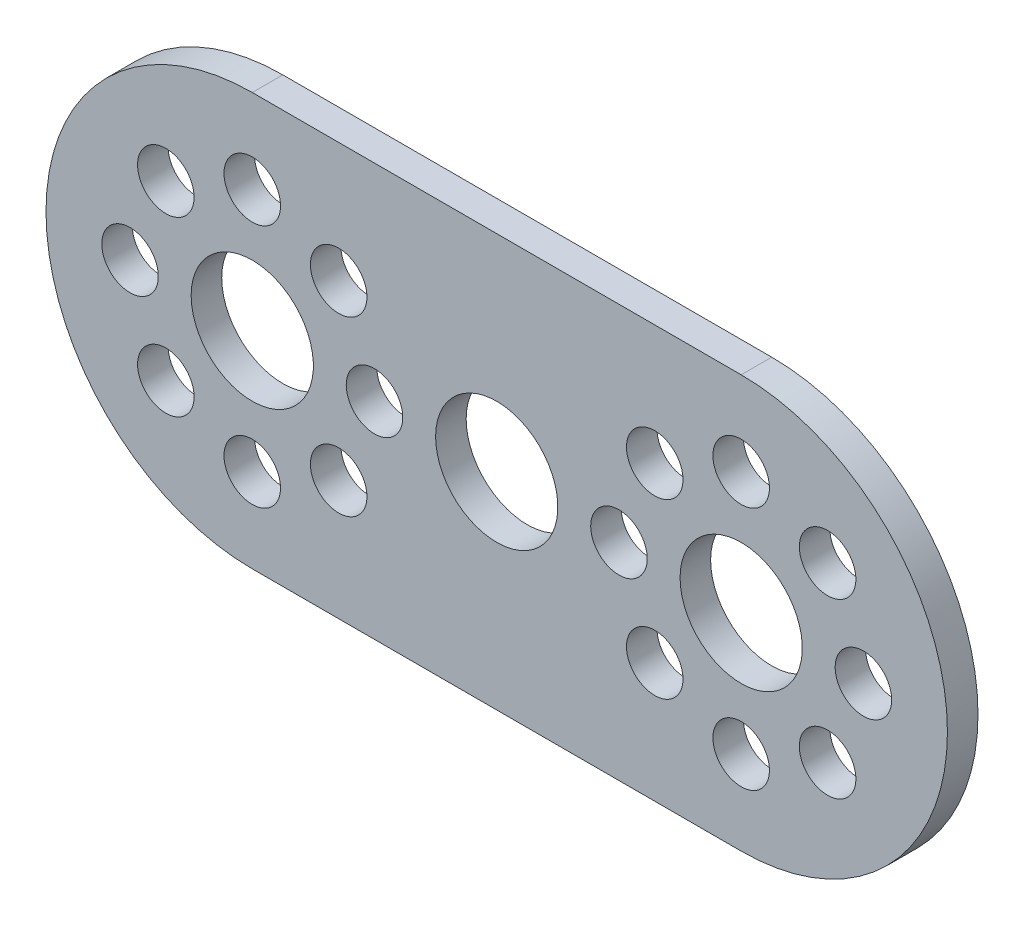
ISO-10303-21;
HEADER;
FILE_DESCRIPTION(('STEP AP214'),'2;1');
FILE_NAME('part.step','',(''),(''),'','','');
FILE_SCHEMA(('AUTOMOTIVE_DESIGN { 1 0 10303 214 1 1 1 1 }'));
ENDSEC;
DATA;
#1=APPLICATION_CONTEXT('core data for automotive mechanical design processes');
#2=APPLICATION_PROTOCOL_DEFINITION('international standard','automotive_design',2000,#1);
#3=PRODUCT_CONTEXT('',#1,'mechanical');
#4=PRODUCT('Part','Part','',(#3));
#5=PRODUCT_RELATED_PRODUCT_CATEGORY('part','',(#4));
#6=PRODUCT_DEFINITION_FORMATION('','',#4);
#7=PRODUCT_DEFINITION_CONTEXT('part definition',#1,'design');
#8=PRODUCT_DEFINITION('design','',#6,#7);
#9=PRODUCT_DEFINITION_SHAPE('','',#8);
#10=(LENGTH_UNIT() NAMED_UNIT(*) SI_UNIT(.MILLI.,.METRE.));
#11=(NAMED_UNIT(*) PLANE_ANGLE_UNIT() SI_UNIT($,.RADIAN.));
#12=(NAMED_UNIT(*) SI_UNIT($,.STERADIAN.) SOLID_ANGLE_UNIT());
#13=UNCERTAINTY_MEASURE_WITH_UNIT(LENGTH_MEASURE(1.E-05),#10,'distance_accuracy_value','');
#14=(GEOMETRIC_REPRESENTATION_CONTEXT(3) GLOBAL_UNCERTAINTY_ASSIGNED_CONTEXT((#13)) GLOBAL_UNIT_ASSIGNED_CONTEXT((#10,
#11,#12)) REPRESENTATION_CONTEXT('',''));
#15=CARTESIAN_POINT('',(0.,0.,0.));
#16=DIRECTION('',(0.,0.,1.));
#17=DIRECTION('',(1.,0.,0.));
#18=AXIS2_PLACEMENT_3D('',#15,#16,#17);
#19=CARTESIAN_POINT('',(-16.,0.,0.));
#20=DIRECTION('',(0.,0.,1.));
#21=DIRECTION('',(1.,0.,0.));
#22=AXIS2_PLACEMENT_3D('',#19,#20,#21);
#23=PLANE('',#22);
#24=CARTESIAN_POINT('',(21.6568542494924,-5.65685424949238,0.));
#25=DIRECTION('',(0.,0.,-1.));
#26=DIRECTION('',(-1.,0.,0.));
#27=AXIS2_PLACEMENT_3D('',#24,#25,#26);
#28=CIRCLE('',#27,1.85);
#29=CARTESIAN_POINT('',(19.8068542494924,-5.65685424949238,0.));
#30=VERTEX_POINT('',#29);
#31=EDGE_CURVE('E141',#30,#30,#28,.F.);
#32=ORIENTED_EDGE('',*,*,#31,.T.);
#33=EDGE_LOOP('',(#32));
#34=FACE_BOUND('',#33,.T.);
#35=CARTESIAN_POINT('',(10.3431457505076,5.65685424949237,0.));
#36=DIRECTION('',(0.,0.,-1.));
#37=DIRECTION('',(-1.,0.,0.));
#38=AXIS2_PLACEMENT_3D('',#35,#36,#37);
#39=CIRCLE('',#38,1.85);
#40=CARTESIAN_POINT('',(8.49314575050761,5.65685424949237,0.));
#41=VERTEX_POINT('',#40);
#42=EDGE_CURVE('E144',#41,#41,#39,.F.);
#43=ORIENTED_EDGE('',*,*,#42,.T.);
#44=EDGE_LOOP('',(#43));
#45=FACE_BOUND('',#44,.T.);
#46=CARTESIAN_POINT('',(-10.3431457505076,5.65685424949239,0.));
#47=DIRECTION('',(0.,0.,-1.));
#48=DIRECTION('',(-1.,0.,0.));
#49=AXIS2_PLACEMENT_3D('',#46,#47,#48);
#50=CIRCLE('',#49,1.85);
#51=CARTESIAN_POINT('',(-12.1931457505076,5.65685424949239,0.));
#52=VERTEX_POINT('',#51);
#53=EDGE_CURVE('E147',#52,#52,#50,.F.);
#54=ORIENTED_EDGE('',*,*,#53,.T.);
#55=EDGE_LOOP('',(#54));
#56=FACE_BOUND('',#55,.T.);
#57=CARTESIAN_POINT('',(10.3431457505076,-5.65685424949239,0.));
#58=DIRECTION('',(0.,0.,-1.));
#59=DIRECTION('',(-1.,0.,0.));
#60=AXIS2_PLACEMENT_3D('',#57,#58,#59);
#61=CIRCLE('',#60,1.85000000000002);
#62=CARTESIAN_POINT('',(8.4931457505076,-5.65685424949239,0.));
#63=VERTEX_POINT('',#62);
#64=EDGE_CURVE('E150',#63,#63,#61,.F.);
#65=ORIENTED_EDGE('',*,*,#64,.T.);
#66=EDGE_LOOP('',(#65));
#67=FACE_BOUND('',#66,.T.);
#68=CARTESIAN_POINT('',(0.,0.,0.));
#69=DIRECTION('',(0.,0.,-1.));
#70=DIRECTION('',(-1.,0.,0.));
#71=AXIS2_PLACEMENT_3D('',#68,#69,#70);
#72=CIRCLE('',#71,4.);
#73=CARTESIAN_POINT('',(-4.,0.,0.));
#74=VERTEX_POINT('',#73);
#75=EDGE_CURVE('E153',#74,#74,#72,.F.);
#76=ORIENTED_EDGE('',*,*,#75,.T.);
#77=EDGE_LOOP('',(#76));
#78=FACE_BOUND('',#77,.T.);
#79=CARTESIAN_POINT('',(-16.,-8.,0.));
#80=DIRECTION('',(0.,0.,-1.));
#81=DIRECTION('',(-1.,0.,0.));
#82=AXIS2_PLACEMENT_3D('',#79,#80,#81);
#83=CIRCLE('',#82,1.85);
#84=CARTESIAN_POINT('',(-17.85,-8.,0.));
#85=VERTEX_POINT('',#84);
#86=EDGE_CURVE('E156',#85,#85,#83,.F.);
#87=ORIENTED_EDGE('',*,*,#86,.T.);
#88=EDGE_LOOP('',(#87));
#89=FACE_BOUND('',#88,.T.);
#90=CARTESIAN_POINT('',(8.,0.,0.));
#91=DIRECTION('',(0.,0.,-1.));
#92=DIRECTION('',(-1.,0.,0.));
#93=AXIS2_PLACEMENT_3D('',#90,#91,#92);
#94=CIRCLE('',#93,1.85);
#95=CARTESIAN_POINT('',(6.15,0.,0.));
#96=VERTEX_POINT('',#95);
#97=EDGE_CURVE('E159',#96,#96,#94,.F.);
#98=ORIENTED_EDGE('',*,*,#97,.T.);
#99=EDGE_LOOP('',(#98));
#100=FACE_BOUND('',#99,.T.);
#101=CARTESIAN_POINT('',(16.,-8.,0.));
#102=DIRECTION('',(0.,0.,-1.));
#103=DIRECTION('',(-1.,0.,0.));
#104=AXIS2_PLACEMENT_3D('',#101,#102,#103);
#105=CIRCLE('',#104,1.85);
#106=CARTESIAN_POINT('',(14.15,-8.,0.));
#107=VERTEX_POINT('',#106);
#108=EDGE_CURVE('E162',#107,#107,#105,.F.);
#109=ORIENTED_EDGE('',*,*,#108,.T.);
#110=EDGE_LOOP('',(#109));
#111=FACE_BOUND('',#110,.T.);
#112=CARTESIAN_POINT('',(-16.,8.,0.));
#113=DIRECTION('',(0.,0.,-1.));
#114=DIRECTION('',(-1.,0.,0.));
#115=AXIS2_PLACEMENT_3D('',#112,#113,#114);
#116=CIRCLE('',#115,1.85);
#117=CARTESIAN_POINT('',(-17.85,8.,0.));
#118=VERTEX_POINT('',#117);
#119=EDGE_CURVE('E165',#118,#118,#116,.F.);
#120=ORIENTED_EDGE('',*,*,#119,.T.);
#121=EDGE_LOOP('',(#120));
#122=FACE_BOUND('',#121,.T.);
#123=CARTESIAN_POINT('',(-16.,0.,0.));
#124=DIRECTION('',(0.,0.,-1.));
#125=DIRECTION('',(-1.,0.,0.));
#126=AXIS2_PLACEMENT_3D('',#123,#124,#125);
#127=CIRCLE('',#126,4.);
#128=CARTESIAN_POINT('',(-20.,0.,0.));
#129=VERTEX_POINT('',#128);
#130=EDGE_CURVE('E168',#129,#129,#127,.F.);
#131=ORIENTED_EDGE('',*,*,#130,.T.);
#132=EDGE_LOOP('',(#131));
#133=FACE_BOUND('',#132,.T.);
#134=CARTESIAN_POINT('',(16.,0.,0.));
#135=DIRECTION('',(0.,0.,-1.));
#136=DIRECTION('',(-1.,0.,0.));
#137=AXIS2_PLACEMENT_3D('',#134,#135,#136);
#138=CIRCLE('',#137,4.);
#139=CARTESIAN_POINT('',(12.,0.,0.));
#140=VERTEX_POINT('',#139);
#141=EDGE_CURVE('E171',#140,#140,#138,.F.);
#142=ORIENTED_EDGE('',*,*,#141,.T.);
#143=EDGE_LOOP('',(#142));
#144=FACE_BOUND('',#143,.T.);
#145=CARTESIAN_POINT('',(16.,8.,0.));
#146=DIRECTION('',(0.,0.,-1.));
#147=DIRECTION('',(-1.,0.,0.));
#148=AXIS2_PLACEMENT_3D('',#145,#146,#147);
#149=CIRCLE('',#148,1.85);
#150=CARTESIAN_POINT('',(14.15,8.,0.));
#151=VERTEX_POINT('',#150);
#152=EDGE_CURVE('E174',#151,#151,#149,.F.);
#153=ORIENTED_EDGE('',*,*,#152,.T.);
#154=EDGE_LOOP('',(#153));
#155=FACE_BOUND('',#154,.T.);
#156=CARTESIAN_POINT('',(24.,0.,0.));
#157=DIRECTION('',(0.,0.,-1.));
#158=DIRECTION('',(-1.,0.,0.));
#159=AXIS2_PLACEMENT_3D('',#156,#157,#158);
#160=CIRCLE('',#159,1.85);
#161=CARTESIAN_POINT('',(22.15,0.,0.));
#162=VERTEX_POINT('',#161);
#163=EDGE_CURVE('E177',#162,#162,#160,.F.);
#164=ORIENTED_EDGE('',*,*,#163,.T.);
#165=EDGE_LOOP('',(#164));
#166=FACE_BOUND('',#165,.T.);
#167=CARTESIAN_POINT('',(-8.,0.,0.));
#168=DIRECTION('',(0.,0.,-1.));
#169=DIRECTION('',(-1.,0.,0.));
#170=AXIS2_PLACEMENT_3D('',#167,#168,#169);
#171=CIRCLE('',#170,1.85);
#172=CARTESIAN_POINT('',(-9.85,0.,0.));
#173=VERTEX_POINT('',#172);
#174=EDGE_CURVE('E180',#173,#173,#171,.F.);
#175=ORIENTED_EDGE('',*,*,#174,.T.);
#176=EDGE_LOOP('',(#175));
#177=FACE_BOUND('',#176,.T.);
#178=CARTESIAN_POINT('',(-24.,0.,0.));
#179=DIRECTION('',(0.,0.,-1.));
#180=DIRECTION('',(-1.,0.,0.));
#181=AXIS2_PLACEMENT_3D('',#178,#179,#180);
#182=CIRCLE('',#181,1.85);
#183=CARTESIAN_POINT('',(-25.85,0.,0.));
#184=VERTEX_POINT('',#183);
#185=EDGE_CURVE('E183',#184,#184,#182,.F.);
#186=ORIENTED_EDGE('',*,*,#185,.T.);
#187=EDGE_LOOP('',(#186));
#188=FACE_BOUND('',#187,.T.);
#189=CARTESIAN_POINT('',(-21.6568542494924,-5.65685424949239,0.));
#190=DIRECTION('',(0.,0.,-1.));
#191=DIRECTION('',(-1.,0.,0.));
#192=AXIS2_PLACEMENT_3D('',#189,#190,#191);
#193=CIRCLE('',#192,1.85);
#194=CARTESIAN_POINT('',(-23.5068542494924,-5.65685424949239,0.));
#195=VERTEX_POINT('',#194);
#196=EDGE_CURVE('E186',#195,#195,#193,.F.);
#197=ORIENTED_EDGE('',*,*,#196,.T.);
#198=EDGE_LOOP('',(#197));
#199=FACE_BOUND('',#198,.T.);
#200=CARTESIAN_POINT('',(-21.6568542494924,5.65685424949237,0.));
#201=DIRECTION('',(0.,0.,-1.));
#202=DIRECTION('',(-1.,0.,0.));
#203=AXIS2_PLACEMENT_3D('',#200,#201,#202);
#204=CIRCLE('',#203,1.85);
#205=CARTESIAN_POINT('',(-23.5068542494924,5.65685424949237,0.));
#206=VERTEX_POINT('',#205);
#207=EDGE_CURVE('E189',#206,#206,#204,.F.);
#208=ORIENTED_EDGE('',*,*,#207,.T.);
#209=EDGE_LOOP('',(#208));
#210=FACE_BOUND('',#209,.T.);
#211=CARTESIAN_POINT('',(-10.3431457505076,-5.65685424949237,0.));
#212=DIRECTION('',(0.,0.,-1.));
#213=DIRECTION('',(-1.,0.,0.));
#214=AXIS2_PLACEMENT_3D('',#211,#212,#213);
#215=CIRCLE('',#214,1.85);
#216=CARTESIAN_POINT('',(-12.1931457505076,-5.65685424949237,0.));
#217=VERTEX_POINT('',#216);
#218=EDGE_CURVE('E192',#217,#217,#215,.F.);
#219=ORIENTED_EDGE('',*,*,#218,.T.);
#220=EDGE_LOOP('',(#219));
#221=FACE_BOUND('',#220,.T.);
#222=CARTESIAN_POINT('',(21.6568542494924,5.65685424949239,0.));
#223=DIRECTION('',(0.,0.,-1.));
#224=DIRECTION('',(-1.,0.,0.));
#225=AXIS2_PLACEMENT_3D('',#222,#223,#224);
#226=CIRCLE('',#225,1.85);
#227=CARTESIAN_POINT('',(19.8068542494924,5.65685424949239,0.));
#228=VERTEX_POINT('',#227);
#229=EDGE_CURVE('E195',#228,#228,#226,.F.);
#230=ORIENTED_EDGE('',*,*,#229,.T.);
#231=EDGE_LOOP('',(#230));
#232=FACE_BOUND('',#231,.T.);
#233=DIRECTION('',(1.,0.,0.));
#234=VECTOR('',#233,1.);
#235=CARTESIAN_POINT('',(-16.,13.5,0.));
#236=LINE('',#235,#234);
#237=CARTESIAN_POINT('',(-16.,13.5,0.));
#238=VERTEX_POINT('',#237);
#239=CARTESIAN_POINT('',(16.,13.5,0.));
#240=VERTEX_POINT('',#239);
#241=EDGE_CURVE('E58',#238,#240,#236,.T.);
#242=ORIENTED_EDGE('',*,*,#241,.T.);
#243=CARTESIAN_POINT('',(16.,0.,0.));
#244=DIRECTION('',(0.,0.,-1.));
#245=DIRECTION('',(-1.,0.,0.));
#246=AXIS2_PLACEMENT_3D('',#243,#244,#245);
#247=CIRCLE('',#246,13.5);
#248=CARTESIAN_POINT('',(16.,-13.5,0.));
#249=VERTEX_POINT('',#248);
#250=EDGE_CURVE('E18',#249,#240,#247,.F.);
#251=ORIENTED_EDGE('',*,*,#250,.F.);
#252=DIRECTION('',(1.,0.,0.));
#253=VECTOR('',#252,1.);
#254=CARTESIAN_POINT('',(-16.,-13.5,0.));
#255=LINE('',#254,#253);
#256=CARTESIAN_POINT('',(-16.,-13.5,0.));
#257=VERTEX_POINT('',#256);
#258=EDGE_CURVE('E53',#249,#257,#255,.F.);
#259=ORIENTED_EDGE('',*,*,#258,.T.);
#260=CARTESIAN_POINT('',(-16.,0.,0.));
#261=DIRECTION('',(0.,0.,-1.));
#262=DIRECTION('',(-1.,0.,0.));
#263=AXIS2_PLACEMENT_3D('',#260,#261,#262);
#264=CIRCLE('',#263,13.5);
#265=EDGE_CURVE('E61',#238,#257,#264,.F.);
#266=ORIENTED_EDGE('',*,*,#265,.F.);
#267=EDGE_LOOP('',(#242,#251,#259,#266));
#268=FACE_BOUND('',#267,.T.);
#269=ADVANCED_FACE('F15',(#34,#45,#56,#67,#78,#89,#100,#111,#122,#133,#144,#155,#166,#177,#188,
#199,#210,#221,#232,#268),#23,.F.);
#270=CARTESIAN_POINT('',(-16.,-13.5,2.));
#271=DIRECTION('',(0.,1.,0.));
#272=DIRECTION('',(0.,0.,1.));
#273=AXIS2_PLACEMENT_3D('',#270,#271,#272);
#274=PLANE('',#273);
#275=DIRECTION('',(1.,0.,0.));
#276=VECTOR('',#275,1.);
#277=CARTESIAN_POINT('',(-16.,-13.5,2.));
#278=LINE('',#277,#276);
#279=CARTESIAN_POINT('',(-16.,-13.5,2.));
#280=VERTEX_POINT('',#279);
#281=CARTESIAN_POINT('',(16.,-13.5,2.));
#282=VERTEX_POINT('',#281);
#283=EDGE_CURVE('E139',#280,#282,#278,.T.);
#284=ORIENTED_EDGE('',*,*,#283,.F.);
#285=DIRECTION('',(0.,0.,-1.));
#286=VECTOR('',#285,1.);
#287=CARTESIAN_POINT('',(-16.,-13.5,2.));
#288=LINE('',#287,#286);
#289=EDGE_CURVE('E75',#257,#280,#288,.F.);
#290=ORIENTED_EDGE('',*,*,#289,.F.);
#291=ORIENTED_EDGE('',*,*,#258,.F.);
#292=DIRECTION('',(0.,0.,-1.));
#293=VECTOR('',#292,1.);
#294=CARTESIAN_POINT('',(16.,-13.5,2.));
#295=LINE('',#294,#293);
#296=EDGE_CURVE('E70',#282,#249,#295,.T.);
#297=ORIENTED_EDGE('',*,*,#296,.F.);
#298=EDGE_LOOP('',(#284,#290,#291,#297));
#299=FACE_BOUND('',#298,.T.);
#300=ADVANCED_FACE('F203',(#299),#274,.F.);
#301=CARTESIAN_POINT('',(16.,0.,2.));
#302=DIRECTION('',(0.,0.,-1.));
#303=DIRECTION('',(-1.,0.,0.));
#304=AXIS2_PLACEMENT_3D('',#301,#302,#303);
#305=CYLINDRICAL_SURFACE('',#304,13.5);
#306=ORIENTED_EDGE('',*,*,#296,.T.);
#307=ORIENTED_EDGE('',*,*,#250,.T.);
#308=DIRECTION('',(0.,0.,-1.));
#309=VECTOR('',#308,1.);
#310=CARTESIAN_POINT('',(16.,13.5,2.));
#311=LINE('',#310,#309);
#312=CARTESIAN_POINT('',(16.,13.5,2.));
#313=VERTEX_POINT('',#312);
#314=EDGE_CURVE('E64',#240,#313,#311,.F.);
#315=ORIENTED_EDGE('',*,*,#314,.T.);
#316=CARTESIAN_POINT('',(16.,0.,2.));
#317=DIRECTION('',(0.,0.,-1.));
#318=DIRECTION('',(-1.,0.,0.));
#319=AXIS2_PLACEMENT_3D('',#316,#317,#318);
#320=CIRCLE('',#319,13.5);
#321=EDGE_CURVE('E137',#282,#313,#320,.F.);
#322=ORIENTED_EDGE('',*,*,#321,.F.);
#323=EDGE_LOOP('',(#306,#307,#315,#322));
#324=FACE_BOUND('',#323,.T.);
#325=ADVANCED_FACE('F67',(#324),#305,.T.);
#326=CARTESIAN_POINT('',(-16.,13.5,2.));
#327=DIRECTION('',(0.,-1.,0.));
#328=DIRECTION('',(0.,0.,-1.));
#329=AXIS2_PLACEMENT_3D('',#326,#327,#328);
#330=PLANE('',#329);
#331=DIRECTION('',(1.,0.,0.));
#332=VECTOR('',#331,1.);
#333=CARTESIAN_POINT('',(-16.,13.5,2.));
#334=LINE('',#333,#332);
#335=CARTESIAN_POINT('',(-16.,13.5,2.));
#336=VERTEX_POINT('',#335);
#337=EDGE_CURVE('E73',#313,#336,#334,.F.);
#338=ORIENTED_EDGE('',*,*,#337,.F.);
#339=ORIENTED_EDGE('',*,*,#314,.F.);
#340=ORIENTED_EDGE('',*,*,#241,.F.);
#341=DIRECTION('',(0.,0.,-1.));
#342=VECTOR('',#341,1.);
#343=CARTESIAN_POINT('',(-16.,13.5,2.));
#344=LINE('',#343,#342);
#345=EDGE_CURVE('E77',#336,#238,#344,.T.);
#346=ORIENTED_EDGE('',*,*,#345,.F.);
#347=EDGE_LOOP('',(#338,#339,#340,#346));
#348=FACE_BOUND('',#347,.T.);
#349=ADVANCED_FACE('F71',(#348),#330,.F.);
#350=CARTESIAN_POINT('',(-16.,0.,2.));
#351=DIRECTION('',(0.,0.,-1.));
#352=DIRECTION('',(-1.,0.,0.));
#353=AXIS2_PLACEMENT_3D('',#350,#351,#352);
#354=CYLINDRICAL_SURFACE('',#353,13.5);
#355=ORIENTED_EDGE('',*,*,#345,.T.);
#356=ORIENTED_EDGE('',*,*,#265,.T.);
#357=ORIENTED_EDGE('',*,*,#289,.T.);
#358=CARTESIAN_POINT('',(-16.,0.,2.));
#359=DIRECTION('',(0.,0.,-1.));
#360=DIRECTION('',(-1.,0.,0.));
#361=AXIS2_PLACEMENT_3D('',#358,#359,#360);
#362=CIRCLE('',#361,13.5);
#363=EDGE_CURVE('E33',#336,#280,#362,.F.);
#364=ORIENTED_EDGE('',*,*,#363,.F.);
#365=EDGE_LOOP('',(#355,#356,#357,#364));
#366=FACE_BOUND('',#365,.T.);
#367=ADVANCED_FACE('F197',(#366),#354,.T.);
#368=CARTESIAN_POINT('',(21.6568542494924,5.65685424949239,2.));
#369=DIRECTION('',(0.,0.,-1.));
#370=DIRECTION('',(-1.,0.,0.));
#371=AXIS2_PLACEMENT_3D('',#368,#369,#370);
#372=CYLINDRICAL_SURFACE('',#371,1.85);
#373=ORIENTED_EDGE('',*,*,#229,.F.);
#374=EDGE_LOOP('',(#373));
#375=FACE_BOUND('',#374,.T.);
#376=CARTESIAN_POINT('',(21.6568542494924,5.65685424949239,2.));
#377=DIRECTION('',(0.,0.,-1.));
#378=DIRECTION('',(-1.,0.,0.));
#379=AXIS2_PLACEMENT_3D('',#376,#377,#378);
#380=CIRCLE('',#379,1.85);
#381=CARTESIAN_POINT('',(19.8068542494924,5.65685424949239,2.));
#382=VERTEX_POINT('',#381);
#383=EDGE_CURVE('E134',#382,#382,#380,.T.);
#384=ORIENTED_EDGE('',*,*,#383,.F.);
#385=EDGE_LOOP('',(#384));
#386=FACE_BOUND('',#385,.T.);
#387=ADVANCED_FACE('F290',(#375,#386),#372,.F.);
#388=CARTESIAN_POINT('',(-10.3431457505076,-5.65685424949237,2.));
#389=DIRECTION('',(0.,0.,-1.));
#390=DIRECTION('',(-1.,0.,0.));
#391=AXIS2_PLACEMENT_3D('',#388,#389,#390);
#392=CYLINDRICAL_SURFACE('',#391,1.85);
#393=ORIENTED_EDGE('',*,*,#218,.F.);
#394=EDGE_LOOP('',(#393));
#395=FACE_BOUND('',#394,.T.);
#396=CARTESIAN_POINT('',(-10.3431457505076,-5.65685424949237,2.));
#397=DIRECTION('',(0.,0.,-1.));
#398=DIRECTION('',(-1.,0.,0.));
#399=AXIS2_PLACEMENT_3D('',#396,#397,#398);
#400=CIRCLE('',#399,1.85);
#401=CARTESIAN_POINT('',(-12.1931457505076,-5.65685424949237,2.));
#402=VERTEX_POINT('',#401);
#403=EDGE_CURVE('E131',#402,#402,#400,.T.);
#404=ORIENTED_EDGE('',*,*,#403,.F.);
#405=EDGE_LOOP('',(#404));
#406=FACE_BOUND('',#405,.T.);
#407=ADVANCED_FACE('F286',(#395,#406),#392,.F.);
#408=CARTESIAN_POINT('',(-21.6568542494924,5.65685424949237,2.));
#409=DIRECTION('',(0.,0.,-1.));
#410=DIRECTION('',(-1.,0.,0.));
#411=AXIS2_PLACEMENT_3D('',#408,#409,#410);
#412=CYLINDRICAL_SURFACE('',#411,1.85);
#413=ORIENTED_EDGE('',*,*,#207,.F.);
#414=EDGE_LOOP('',(#413));
#415=FACE_BOUND('',#414,.T.);
#416=CARTESIAN_POINT('',(-21.6568542494924,5.65685424949237,2.));
#417=DIRECTION('',(0.,0.,-1.));
#418=DIRECTION('',(-1.,0.,0.));
#419=AXIS2_PLACEMENT_3D('',#416,#417,#418);
#420=CIRCLE('',#419,1.85);
#421=CARTESIAN_POINT('',(-23.5068542494924,5.65685424949237,2.));
#422=VERTEX_POINT('',#421);
#423=EDGE_CURVE('E128',#422,#422,#420,.T.);
#424=ORIENTED_EDGE('',*,*,#423,.F.);
#425=EDGE_LOOP('',(#424));
#426=FACE_BOUND('',#425,.T.);
#427=ADVANCED_FACE('F282',(#415,#426),#412,.F.);
#428=CARTESIAN_POINT('',(-21.6568542494924,-5.65685424949239,2.));
#429=DIRECTION('',(0.,0.,-1.));
#430=DIRECTION('',(-1.,0.,0.));
#431=AXIS2_PLACEMENT_3D('',#428,#429,#430);
#432=CYLINDRICAL_SURFACE('',#431,1.85);
#433=ORIENTED_EDGE('',*,*,#196,.F.);
#434=EDGE_LOOP('',(#433));
#435=FACE_BOUND('',#434,.T.);
#436=CARTESIAN_POINT('',(-21.6568542494924,-5.65685424949239,2.));
#437=DIRECTION('',(0.,0.,-1.));
#438=DIRECTION('',(-1.,0.,0.));
#439=AXIS2_PLACEMENT_3D('',#436,#437,#438);
#440=CIRCLE('',#439,1.85);
#441=CARTESIAN_POINT('',(-23.5068542494924,-5.65685424949239,2.));
#442=VERTEX_POINT('',#441);
#443=EDGE_CURVE('E125',#442,#442,#440,.T.);
#444=ORIENTED_EDGE('',*,*,#443,.F.);
#445=EDGE_LOOP('',(#444));
#446=FACE_BOUND('',#445,.T.);
#447=ADVANCED_FACE('F278',(#435,#446),#432,.F.);
#448=CARTESIAN_POINT('',(-24.,0.,2.));
#449=DIRECTION('',(0.,0.,-1.));
#450=DIRECTION('',(-1.,0.,0.));
#451=AXIS2_PLACEMENT_3D('',#448,#449,#450);
#452=CYLINDRICAL_SURFACE('',#451,1.85);
#453=ORIENTED_EDGE('',*,*,#185,.F.);
#454=EDGE_LOOP('',(#453));
#455=FACE_BOUND('',#454,.T.);
#456=CARTESIAN_POINT('',(-24.,0.,2.));
#457=DIRECTION('',(0.,0.,-1.));
#458=DIRECTION('',(-1.,0.,0.));
#459=AXIS2_PLACEMENT_3D('',#456,#457,#458);
#460=CIRCLE('',#459,1.85);
#461=CARTESIAN_POINT('',(-25.85,0.,2.));
#462=VERTEX_POINT('',#461);
#463=EDGE_CURVE('E122',#462,#462,#460,.T.);
#464=ORIENTED_EDGE('',*,*,#463,.F.);
#465=EDGE_LOOP('',(#464));
#466=FACE_BOUND('',#465,.T.);
#467=ADVANCED_FACE('F274',(#455,#466),#452,.F.);
#468=CARTESIAN_POINT('',(-8.,0.,2.));
#469=DIRECTION('',(0.,0.,-1.));
#470=DIRECTION('',(-1.,0.,0.));
#471=AXIS2_PLACEMENT_3D('',#468,#469,#470);
#472=CYLINDRICAL_SURFACE('',#471,1.85);
#473=ORIENTED_EDGE('',*,*,#174,.F.);
#474=EDGE_LOOP('',(#473));
#475=FACE_BOUND('',#474,.T.);
#476=CARTESIAN_POINT('',(-8.,0.,2.));
#477=DIRECTION('',(0.,0.,-1.));
#478=DIRECTION('',(-1.,0.,0.));
#479=AXIS2_PLACEMENT_3D('',#476,#477,#478);
#480=CIRCLE('',#479,1.85);
#481=CARTESIAN_POINT('',(-9.85,0.,2.));
#482=VERTEX_POINT('',#481);
#483=EDGE_CURVE('E119',#482,#482,#480,.T.);
#484=ORIENTED_EDGE('',*,*,#483,.F.);
#485=EDGE_LOOP('',(#484));
#486=FACE_BOUND('',#485,.T.);
#487=ADVANCED_FACE('F270',(#475,#486),#472,.F.);
#488=CARTESIAN_POINT('',(24.,0.,2.));
#489=DIRECTION('',(0.,0.,-1.));
#490=DIRECTION('',(-1.,0.,0.));
#491=AXIS2_PLACEMENT_3D('',#488,#489,#490);
#492=CYLINDRICAL_SURFACE('',#491,1.85);
#493=ORIENTED_EDGE('',*,*,#163,.F.);
#494=EDGE_LOOP('',(#493));
#495=FACE_BOUND('',#494,.T.);
#496=CARTESIAN_POINT('',(24.,0.,2.));
#497=DIRECTION('',(0.,0.,-1.));
#498=DIRECTION('',(-1.,0.,0.));
#499=AXIS2_PLACEMENT_3D('',#496,#497,#498);
#500=CIRCLE('',#499,1.85);
#501=CARTESIAN_POINT('',(22.15,0.,2.));
#502=VERTEX_POINT('',#501);
#503=EDGE_CURVE('E116',#502,#502,#500,.T.);
#504=ORIENTED_EDGE('',*,*,#503,.F.);
#505=EDGE_LOOP('',(#504));
#506=FACE_BOUND('',#505,.T.);
#507=ADVANCED_FACE('F266',(#495,#506),#492,.F.);
#508=CARTESIAN_POINT('',(16.,8.,2.));
#509=DIRECTION('',(0.,0.,-1.));
#510=DIRECTION('',(-1.,0.,0.));
#511=AXIS2_PLACEMENT_3D('',#508,#509,#510);
#512=CYLINDRICAL_SURFACE('',#511,1.85);
#513=ORIENTED_EDGE('',*,*,#152,.F.);
#514=EDGE_LOOP('',(#513));
#515=FACE_BOUND('',#514,.T.);
#516=CARTESIAN_POINT('',(16.,8.,2.));
#517=DIRECTION('',(0.,0.,-1.));
#518=DIRECTION('',(-1.,0.,0.));
#519=AXIS2_PLACEMENT_3D('',#516,#517,#518);
#520=CIRCLE('',#519,1.85);
#521=CARTESIAN_POINT('',(14.15,8.,2.));
#522=VERTEX_POINT('',#521);
#523=EDGE_CURVE('E113',#522,#522,#520,.T.);
#524=ORIENTED_EDGE('',*,*,#523,.F.);
#525=EDGE_LOOP('',(#524));
#526=FACE_BOUND('',#525,.T.);
#527=ADVANCED_FACE('F262',(#515,#526),#512,.F.);
#528=CARTESIAN_POINT('',(16.,0.,2.));
#529=DIRECTION('',(0.,0.,-1.));
#530=DIRECTION('',(-1.,0.,0.));
#531=AXIS2_PLACEMENT_3D('',#528,#529,#530);
#532=CYLINDRICAL_SURFACE('',#531,4.);
#533=ORIENTED_EDGE('',*,*,#141,.F.);
#534=EDGE_LOOP('',(#533));
#535=FACE_BOUND('',#534,.T.);
#536=CARTESIAN_POINT('',(16.,0.,2.));
#537=DIRECTION('',(0.,0.,-1.));
#538=DIRECTION('',(-1.,0.,0.));
#539=AXIS2_PLACEMENT_3D('',#536,#537,#538);
#540=CIRCLE('',#539,4.);
#541=CARTESIAN_POINT('',(12.,0.,2.));
#542=VERTEX_POINT('',#541);
#543=EDGE_CURVE('E110',#542,#542,#540,.T.);
#544=ORIENTED_EDGE('',*,*,#543,.F.);
#545=EDGE_LOOP('',(#544));
#546=FACE_BOUND('',#545,.T.);
#547=ADVANCED_FACE('F258',(#535,#546),#532,.F.);
#548=CARTESIAN_POINT('',(-16.,0.,2.));
#549=DIRECTION('',(0.,0.,-1.));
#550=DIRECTION('',(-1.,0.,0.));
#551=AXIS2_PLACEMENT_3D('',#548,#549,#550);
#552=CYLINDRICAL_SURFACE('',#551,4.);
#553=ORIENTED_EDGE('',*,*,#130,.F.);
#554=EDGE_LOOP('',(#553));
#555=FACE_BOUND('',#554,.T.);
#556=CARTESIAN_POINT('',(-16.,0.,2.));
#557=DIRECTION('',(0.,0.,-1.));
#558=DIRECTION('',(-1.,0.,0.));
#559=AXIS2_PLACEMENT_3D('',#556,#557,#558);
#560=CIRCLE('',#559,4.);
#561=CARTESIAN_POINT('',(-20.,0.,2.));
#562=VERTEX_POINT('',#561);
#563=EDGE_CURVE('E107',#562,#562,#560,.T.);
#564=ORIENTED_EDGE('',*,*,#563,.F.);
#565=EDGE_LOOP('',(#564));
#566=FACE_BOUND('',#565,.T.);
#567=ADVANCED_FACE('F254',(#555,#566),#552,.F.);
#568=CARTESIAN_POINT('',(-16.,8.,2.));
#569=DIRECTION('',(0.,0.,-1.));
#570=DIRECTION('',(-1.,0.,0.));
#571=AXIS2_PLACEMENT_3D('',#568,#569,#570);
#572=CYLINDRICAL_SURFACE('',#571,1.85);
#573=ORIENTED_EDGE('',*,*,#119,.F.);
#574=EDGE_LOOP('',(#573));
#575=FACE_BOUND('',#574,.T.);
#576=CARTESIAN_POINT('',(-16.,8.,2.));
#577=DIRECTION('',(0.,0.,-1.));
#578=DIRECTION('',(-1.,0.,0.));
#579=AXIS2_PLACEMENT_3D('',#576,#577,#578);
#580=CIRCLE('',#579,1.85);
#581=CARTESIAN_POINT('',(-17.85,8.,2.));
#582=VERTEX_POINT('',#581);
#583=EDGE_CURVE('E104',#582,#582,#580,.T.);
#584=ORIENTED_EDGE('',*,*,#583,.F.);
#585=EDGE_LOOP('',(#584));
#586=FACE_BOUND('',#585,.T.);
#587=ADVANCED_FACE('F250',(#575,#586),#572,.F.);
#588=CARTESIAN_POINT('',(16.,-8.,2.));
#589=DIRECTION('',(0.,0.,-1.));
#590=DIRECTION('',(-1.,0.,0.));
#591=AXIS2_PLACEMENT_3D('',#588,#589,#590);
#592=CYLINDRICAL_SURFACE('',#591,1.85);
#593=ORIENTED_EDGE('',*,*,#108,.F.);
#594=EDGE_LOOP('',(#593));
#595=FACE_BOUND('',#594,.T.);
#596=CARTESIAN_POINT('',(16.,-8.,2.));
#597=DIRECTION('',(0.,0.,-1.));
#598=DIRECTION('',(-1.,0.,0.));
#599=AXIS2_PLACEMENT_3D('',#596,#597,#598);
#600=CIRCLE('',#599,1.85);
#601=CARTESIAN_POINT('',(14.15,-8.,2.));
#602=VERTEX_POINT('',#601);
#603=EDGE_CURVE('E101',#602,#602,#600,.T.);
#604=ORIENTED_EDGE('',*,*,#603,.F.);
#605=EDGE_LOOP('',(#604));
#606=FACE_BOUND('',#605,.T.);
#607=ADVANCED_FACE('F246',(#595,#606),#592,.F.);
#608=CARTESIAN_POINT('',(8.,0.,2.));
#609=DIRECTION('',(0.,0.,-1.));
#610=DIRECTION('',(-1.,0.,0.));
#611=AXIS2_PLACEMENT_3D('',#608,#609,#610);
#612=CYLINDRICAL_SURFACE('',#611,1.85);
#613=ORIENTED_EDGE('',*,*,#97,.F.);
#614=EDGE_LOOP('',(#613));
#615=FACE_BOUND('',#614,.T.);
#616=CARTESIAN_POINT('',(8.,0.,2.));
#617=DIRECTION('',(0.,0.,-1.));
#618=DIRECTION('',(-1.,0.,0.));
#619=AXIS2_PLACEMENT_3D('',#616,#617,#618);
#620=CIRCLE('',#619,1.85);
#621=CARTESIAN_POINT('',(6.15,0.,2.));
#622=VERTEX_POINT('',#621);
#623=EDGE_CURVE('E98',#622,#622,#620,.T.);
#624=ORIENTED_EDGE('',*,*,#623,.F.);
#625=EDGE_LOOP('',(#624));
#626=FACE_BOUND('',#625,.T.);
#627=ADVANCED_FACE('F242',(#615,#626),#612,.F.);
#628=CARTESIAN_POINT('',(-16.,-8.,2.));
#629=DIRECTION('',(0.,0.,-1.));
#630=DIRECTION('',(-1.,0.,0.));
#631=AXIS2_PLACEMENT_3D('',#628,#629,#630);
#632=CYLINDRICAL_SURFACE('',#631,1.85);
#633=ORIENTED_EDGE('',*,*,#86,.F.);
#634=EDGE_LOOP('',(#633));
#635=FACE_BOUND('',#634,.T.);
#636=CARTESIAN_POINT('',(-16.,-8.,2.));
#637=DIRECTION('',(0.,0.,-1.));
#638=DIRECTION('',(-1.,0.,0.));
#639=AXIS2_PLACEMENT_3D('',#636,#637,#638);
#640=CIRCLE('',#639,1.85);
#641=CARTESIAN_POINT('',(-17.85,-8.,2.));
#642=VERTEX_POINT('',#641);
#643=EDGE_CURVE('E95',#642,#642,#640,.T.);
#644=ORIENTED_EDGE('',*,*,#643,.F.);
#645=EDGE_LOOP('',(#644));
#646=FACE_BOUND('',#645,.T.);
#647=ADVANCED_FACE('F238',(#635,#646),#632,.F.);
#648=CARTESIAN_POINT('',(0.,0.,2.));
#649=DIRECTION('',(0.,0.,-1.));
#650=DIRECTION('',(-1.,0.,0.));
#651=AXIS2_PLACEMENT_3D('',#648,#649,#650);
#652=CYLINDRICAL_SURFACE('',#651,4.);
#653=ORIENTED_EDGE('',*,*,#75,.F.);
#654=EDGE_LOOP('',(#653));
#655=FACE_BOUND('',#654,.T.);
#656=CARTESIAN_POINT('',(0.,0.,2.));
#657=DIRECTION('',(0.,0.,-1.));
#658=DIRECTION('',(-1.,0.,0.));
#659=AXIS2_PLACEMENT_3D('',#656,#657,#658);
#660=CIRCLE('',#659,4.);
#661=CARTESIAN_POINT('',(-4.,0.,2.));
#662=VERTEX_POINT('',#661);
#663=EDGE_CURVE('E92',#662,#662,#660,.T.);
#664=ORIENTED_EDGE('',*,*,#663,.F.);
#665=EDGE_LOOP('',(#664));
#666=FACE_BOUND('',#665,.T.);
#667=ADVANCED_FACE('F234',(#655,#666),#652,.F.);
#668=CARTESIAN_POINT('',(10.3431457505076,-5.65685424949239,2.));
#669=DIRECTION('',(0.,0.,-1.));
#670=DIRECTION('',(-1.,0.,0.));
#671=AXIS2_PLACEMENT_3D('',#668,#669,#670);
#672=CYLINDRICAL_SURFACE('',#671,1.85000000000002);
#673=ORIENTED_EDGE('',*,*,#64,.F.);
#674=EDGE_LOOP('',(#673));
#675=FACE_BOUND('',#674,.T.);
#676=CARTESIAN_POINT('',(10.3431457505076,-5.65685424949239,2.));
#677=DIRECTION('',(0.,0.,-1.));
#678=DIRECTION('',(-1.,0.,0.));
#679=AXIS2_PLACEMENT_3D('',#676,#677,#678);
#680=CIRCLE('',#679,1.85000000000002);
#681=CARTESIAN_POINT('',(8.4931457505076,-5.65685424949239,2.));
#682=VERTEX_POINT('',#681);
#683=EDGE_CURVE('E89',#682,#682,#680,.T.);
#684=ORIENTED_EDGE('',*,*,#683,.F.);
#685=EDGE_LOOP('',(#684));
#686=FACE_BOUND('',#685,.T.);
#687=ADVANCED_FACE('F230',(#675,#686),#672,.F.);
#688=CARTESIAN_POINT('',(-10.3431457505076,5.65685424949239,2.));
#689=DIRECTION('',(0.,0.,-1.));
#690=DIRECTION('',(-1.,0.,0.));
#691=AXIS2_PLACEMENT_3D('',#688,#689,#690);
#692=CYLINDRICAL_SURFACE('',#691,1.85);
#693=ORIENTED_EDGE('',*,*,#53,.F.);
#694=EDGE_LOOP('',(#693));
#695=FACE_BOUND('',#694,.T.);
#696=CARTESIAN_POINT('',(-10.3431457505076,5.65685424949239,2.));
#697=DIRECTION('',(0.,0.,-1.));
#698=DIRECTION('',(-1.,0.,0.));
#699=AXIS2_PLACEMENT_3D('',#696,#697,#698);
#700=CIRCLE('',#699,1.85);
#701=CARTESIAN_POINT('',(-12.1931457505076,5.65685424949239,2.));
#702=VERTEX_POINT('',#701);
#703=EDGE_CURVE('E86',#702,#702,#700,.T.);
#704=ORIENTED_EDGE('',*,*,#703,.F.);
#705=EDGE_LOOP('',(#704));
#706=FACE_BOUND('',#705,.T.);
#707=ADVANCED_FACE('F226',(#695,#706),#692,.F.);
#708=CARTESIAN_POINT('',(10.3431457505076,5.65685424949237,2.));
#709=DIRECTION('',(0.,0.,-1.));
#710=DIRECTION('',(-1.,0.,0.));
#711=AXIS2_PLACEMENT_3D('',#708,#709,#710);
#712=CYLINDRICAL_SURFACE('',#711,1.85);
#713=ORIENTED_EDGE('',*,*,#42,.F.);
#714=EDGE_LOOP('',(#713));
#715=FACE_BOUND('',#714,.T.);
#716=CARTESIAN_POINT('',(10.3431457505076,5.65685424949237,2.));
#717=DIRECTION('',(0.,0.,-1.));
#718=DIRECTION('',(-1.,0.,0.));
#719=AXIS2_PLACEMENT_3D('',#716,#717,#718);
#720=CIRCLE('',#719,1.85);
#721=CARTESIAN_POINT('',(8.49314575050761,5.65685424949237,2.));
#722=VERTEX_POINT('',#721);
#723=EDGE_CURVE('E24',#722,#722,#720,.T.);
#724=ORIENTED_EDGE('',*,*,#723,.F.);
#725=EDGE_LOOP('',(#724));
#726=FACE_BOUND('',#725,.T.);
#727=ADVANCED_FACE('F219',(#715,#726),#712,.F.);
#728=CARTESIAN_POINT('',(21.6568542494924,-5.65685424949238,2.));
#729=DIRECTION('',(0.,0.,-1.));
#730=DIRECTION('',(-1.,0.,0.));
#731=AXIS2_PLACEMENT_3D('',#728,#729,#730);
#732=CYLINDRICAL_SURFACE('',#731,1.85);
#733=ORIENTED_EDGE('',*,*,#31,.F.);
#734=EDGE_LOOP('',(#733));
#735=FACE_BOUND('',#734,.T.);
#736=CARTESIAN_POINT('',(21.6568542494924,-5.65685424949238,2.));
#737=DIRECTION('',(0.,0.,-1.));
#738=DIRECTION('',(-1.,0.,0.));
#739=AXIS2_PLACEMENT_3D('',#736,#737,#738);
#740=CIRCLE('',#739,1.85);
#741=CARTESIAN_POINT('',(19.8068542494924,-5.65685424949238,2.));
#742=VERTEX_POINT('',#741);
#743=EDGE_CURVE('E10',#742,#742,#740,.T.);
#744=ORIENTED_EDGE('',*,*,#743,.F.);
#745=EDGE_LOOP('',(#744));
#746=FACE_BOUND('',#745,.T.);
#747=ADVANCED_FACE('F213',(#735,#746),#732,.F.);
#748=CARTESIAN_POINT('',(-16.,0.,2.));
#749=DIRECTION('',(0.,0.,1.));
#750=DIRECTION('',(1.,0.,0.));
#751=AXIS2_PLACEMENT_3D('',#748,#749,#750);
#752=PLANE('',#751);
#753=ORIENTED_EDGE('',*,*,#743,.T.);
#754=EDGE_LOOP('',(#753));
#755=FACE_BOUND('',#754,.T.);
#756=ORIENTED_EDGE('',*,*,#723,.T.);
#757=EDGE_LOOP('',(#756));
#758=FACE_BOUND('',#757,.T.);
#759=ORIENTED_EDGE('',*,*,#703,.T.);
#760=EDGE_LOOP('',(#759));
#761=FACE_BOUND('',#760,.T.);
#762=ORIENTED_EDGE('',*,*,#683,.T.);
#763=EDGE_LOOP('',(#762));
#764=FACE_BOUND('',#763,.T.);
#765=ORIENTED_EDGE('',*,*,#663,.T.);
#766=EDGE_LOOP('',(#765));
#767=FACE_BOUND('',#766,.T.);
#768=ORIENTED_EDGE('',*,*,#643,.T.);
#769=EDGE_LOOP('',(#768));
#770=FACE_BOUND('',#769,.T.);
#771=ORIENTED_EDGE('',*,*,#623,.T.);
#772=EDGE_LOOP('',(#771));
#773=FACE_BOUND('',#772,.T.);
#774=ORIENTED_EDGE('',*,*,#603,.T.);
#775=EDGE_LOOP('',(#774));
#776=FACE_BOUND('',#775,.T.);
#777=ORIENTED_EDGE('',*,*,#583,.T.);
#778=EDGE_LOOP('',(#777));
#779=FACE_BOUND('',#778,.T.);
#780=ORIENTED_EDGE('',*,*,#563,.T.);
#781=EDGE_LOOP('',(#780));
#782=FACE_BOUND('',#781,.T.);
#783=ORIENTED_EDGE('',*,*,#543,.T.);
#784=EDGE_LOOP('',(#783));
#785=FACE_BOUND('',#784,.T.);
#786=ORIENTED_EDGE('',*,*,#523,.T.);
#787=EDGE_LOOP('',(#786));
#788=FACE_BOUND('',#787,.T.);
#789=ORIENTED_EDGE('',*,*,#503,.T.);
#790=EDGE_LOOP('',(#789));
#791=FACE_BOUND('',#790,.T.);
#792=ORIENTED_EDGE('',*,*,#483,.T.);
#793=EDGE_LOOP('',(#792));
#794=FACE_BOUND('',#793,.T.);
#795=ORIENTED_EDGE('',*,*,#463,.T.);
#796=EDGE_LOOP('',(#795));
#797=FACE_BOUND('',#796,.T.);
#798=ORIENTED_EDGE('',*,*,#443,.T.);
#799=EDGE_LOOP('',(#798));
#800=FACE_BOUND('',#799,.T.);
#801=ORIENTED_EDGE('',*,*,#423,.T.);
#802=EDGE_LOOP('',(#801));
#803=FACE_BOUND('',#802,.T.);
#804=ORIENTED_EDGE('',*,*,#403,.T.);
#805=EDGE_LOOP('',(#804));
#806=FACE_BOUND('',#805,.T.);
#807=ORIENTED_EDGE('',*,*,#383,.T.);
#808=EDGE_LOOP('',(#807));
#809=FACE_BOUND('',#808,.T.);
#810=ORIENTED_EDGE('',*,*,#337,.T.);
#811=ORIENTED_EDGE('',*,*,#363,.T.);
#812=ORIENTED_EDGE('',*,*,#283,.T.);
#813=ORIENTED_EDGE('',*,*,#321,.T.);
#814=EDGE_LOOP('',(#810,#811,#812,#813));
#815=FACE_BOUND('',#814,.T.);
#816=ADVANCED_FACE('F199',(#755,#758,#761,#764,#767,#770,#773,#776,#779,#782,#785,#788,#791,
#794,#797,#800,#803,#806,#809,#815),#752,.T.);
#817=CLOSED_SHELL('',(#269,#300,#325,#349,#367,#387,#407,#427,#447,#467,#487,#507,#527,#547,
#567,#587,#607,#627,#647,#667,#687,#707,#727,#747,#816));
#818=MANIFOLD_SOLID_BREP('B1',#817);
#819=ADVANCED_BREP_SHAPE_REPRESENTATION('',(#18,#818),#14);
#820=SHAPE_DEFINITION_REPRESENTATION(#9,#819);
ENDSEC;
END-ISO-10303-21;
